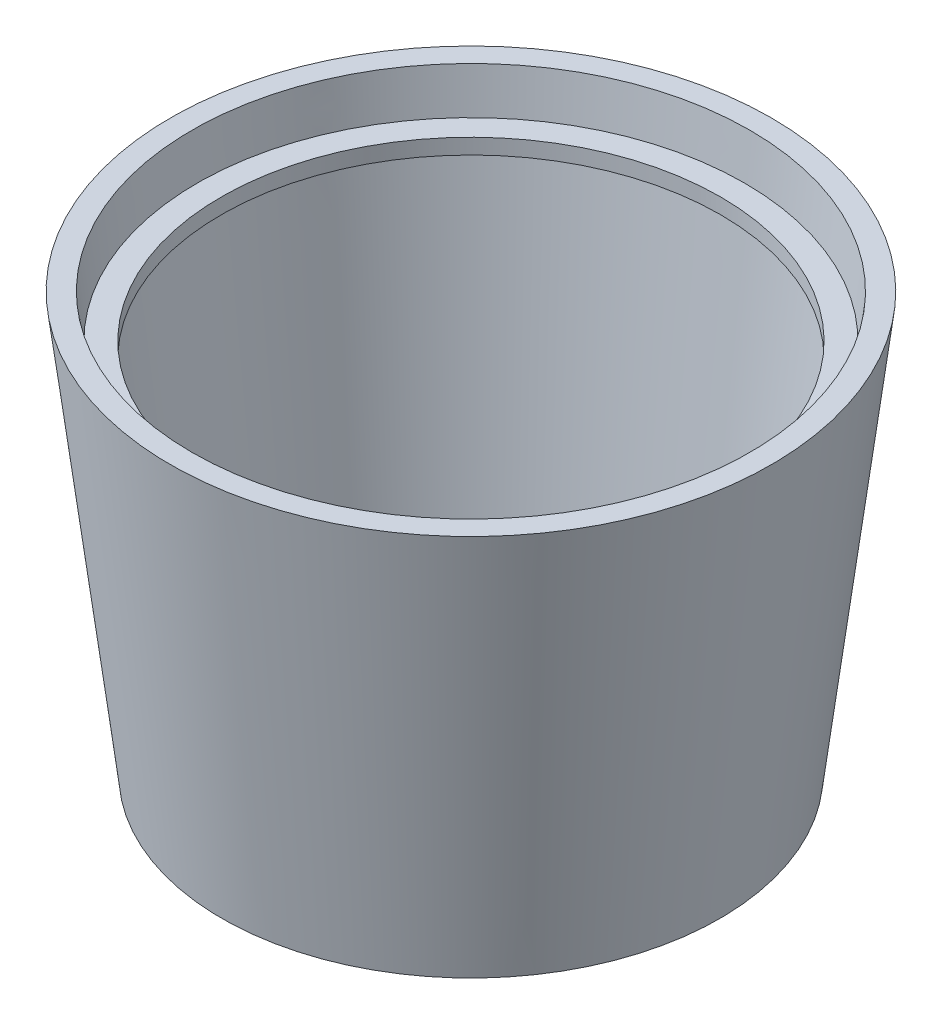
ISO-10303-21;
HEADER;
FILE_DESCRIPTION(('STEP AP214'),'2;1');
FILE_NAME('part.step','',(''),(''),'','','');
FILE_SCHEMA(('AUTOMOTIVE_DESIGN { 1 0 10303 214 1 1 1 1 }'));
ENDSEC;
DATA;
#1=APPLICATION_CONTEXT('core data for automotive mechanical design processes');
#2=APPLICATION_PROTOCOL_DEFINITION('international standard','automotive_design',2000,#1);
#3=PRODUCT_CONTEXT('',#1,'mechanical');
#4=PRODUCT('Part','Part','',(#3));
#5=PRODUCT_RELATED_PRODUCT_CATEGORY('part','',(#4));
#6=PRODUCT_DEFINITION_FORMATION('','',#4);
#7=PRODUCT_DEFINITION_CONTEXT('part definition',#1,'design');
#8=PRODUCT_DEFINITION('design','',#6,#7);
#9=PRODUCT_DEFINITION_SHAPE('','',#8);
#10=(LENGTH_UNIT() NAMED_UNIT(*) SI_UNIT(.MILLI.,.METRE.));
#11=(NAMED_UNIT(*) PLANE_ANGLE_UNIT() SI_UNIT($,.RADIAN.));
#12=(NAMED_UNIT(*) SI_UNIT($,.STERADIAN.) SOLID_ANGLE_UNIT());
#13=UNCERTAINTY_MEASURE_WITH_UNIT(LENGTH_MEASURE(1.E-05),#10,'distance_accuracy_value','');
#14=(GEOMETRIC_REPRESENTATION_CONTEXT(3) GLOBAL_UNCERTAINTY_ASSIGNED_CONTEXT((#13)) GLOBAL_UNIT_ASSIGNED_CONTEXT((#10,
#11,#12)) REPRESENTATION_CONTEXT('',''));
#15=CARTESIAN_POINT('',(0.,0.,0.));
#16=DIRECTION('',(0.,0.,1.));
#17=DIRECTION('',(1.,0.,0.));
#18=AXIS2_PLACEMENT_3D('',#15,#16,#17);
#19=CARTESIAN_POINT('',(-752.,0.,0.));
#20=DIRECTION('',(0.,-1.,0.));
#21=DIRECTION('',(0.,0.,-1.));
#22=AXIS2_PLACEMENT_3D('',#19,#20,#21);
#23=CYLINDRICAL_SURFACE('',#22,470.946113883419);
#24=CARTESIAN_POINT('',(-752.,0.,0.));
#25=DIRECTION('',(0.,-1.,0.));
#26=DIRECTION('',(0.,0.,-1.));
#27=AXIS2_PLACEMENT_3D('',#24,#25,#26);
#28=CIRCLE('',#27,470.946113883419);
#29=CARTESIAN_POINT('',(-752.,0.,-470.946113883419));
#30=VERTEX_POINT('',#29);
#31=EDGE_CURVE('E67',#30,#30,#28,.T.);
#32=ORIENTED_EDGE('',*,*,#31,.T.);
#33=EDGE_LOOP('',(#32));
#34=FACE_BOUND('',#33,.T.);
#35=CARTESIAN_POINT('',(-752.,14.,0.));
#36=DIRECTION('',(0.,-1.,0.));
#37=DIRECTION('',(0.,0.,-1.));
#38=AXIS2_PLACEMENT_3D('',#35,#36,#37);
#39=CIRCLE('',#38,470.946113883419);
#40=CARTESIAN_POINT('',(-752.,14.,-470.946113883419));
#41=VERTEX_POINT('',#40);
#42=EDGE_CURVE('E10',#41,#41,#39,.T.);
#43=ORIENTED_EDGE('',*,*,#42,.F.);
#44=EDGE_LOOP('',(#43));
#45=FACE_BOUND('',#44,.T.);
#46=ADVANCED_FACE('F33',(#34,#45),#23,.F.);
#47=CARTESIAN_POINT('',(-281.053886116581,13.9999999999999,0.));
#48=DIRECTION('',(0.,1.,0.));
#49=DIRECTION('',(0.,0.,1.));
#50=AXIS2_PLACEMENT_3D('',#47,#48,#49);
#51=PLANE('',#50);
#52=ORIENTED_EDGE('',*,*,#42,.T.);
#53=EDGE_LOOP('',(#52));
#54=FACE_BOUND('',#53,.T.);
#55=CARTESIAN_POINT('',(-752.,13.9999999999998,0.));
#56=DIRECTION('',(0.,-1.,0.));
#57=DIRECTION('',(0.,0.,-1.));
#58=AXIS2_PLACEMENT_3D('',#55,#56,#57);
#59=CIRCLE('',#58,504.848705121737);
#60=CARTESIAN_POINT('',(-752.,13.9999999999998,-504.848705121737));
#61=VERTEX_POINT('',#60);
#62=EDGE_CURVE('E39',#61,#61,#59,.T.);
#63=ORIENTED_EDGE('',*,*,#62,.F.);
#64=EDGE_LOOP('',(#63));
#65=FACE_BOUND('',#64,.T.);
#66=ADVANCED_FACE('F85',(#54,#65),#51,.T.);
#67=CARTESIAN_POINT('',(-752.,782.547470571913,0.));
#68=DIRECTION('',(0.,1.,0.));
#69=DIRECTION('',(0.,0.,1.));
#70=AXIS2_PLACEMENT_3D('',#67,#68,#69);
#71=CONICAL_SURFACE('',#70,599.214468828943,0.122173047639597);
#72=ORIENTED_EDGE('',*,*,#62,.T.);
#73=EDGE_LOOP('',(#72));
#74=FACE_BOUND('',#73,.T.);
#75=CARTESIAN_POINT('',(-752.,782.547470571913,0.));
#76=DIRECTION('',(0.,-1.,0.));
#77=DIRECTION('',(0.,0.,-1.));
#78=AXIS2_PLACEMENT_3D('',#75,#76,#77);
#79=CIRCLE('',#78,599.214468828943);
#80=CARTESIAN_POINT('',(-752.,782.547470571913,-599.214468828943));
#81=VERTEX_POINT('',#80);
#82=EDGE_CURVE('E43',#81,#81,#79,.T.);
#83=ORIENTED_EDGE('',*,*,#82,.F.);
#84=EDGE_LOOP('',(#83));
#85=FACE_BOUND('',#84,.T.);
#86=ADVANCED_FACE('F89',(#74,#85),#71,.F.);
#87=CARTESIAN_POINT('',(-209.399700552979,782.547470571913,0.));
#88=DIRECTION('',(0.,-1.,0.));
#89=DIRECTION('',(0.,0.,-1.));
#90=AXIS2_PLACEMENT_3D('',#87,#88,#89);
#91=PLANE('',#90);
#92=ORIENTED_EDGE('',*,*,#82,.T.);
#93=EDGE_LOOP('',(#92));
#94=FACE_BOUND('',#93,.T.);
#95=CARTESIAN_POINT('',(-752.,782.547470571913,0.));
#96=DIRECTION('',(0.,-1.,0.));
#97=DIRECTION('',(0.,0.,-1.));
#98=AXIS2_PLACEMENT_3D('',#95,#96,#97);
#99=CIRCLE('',#98,542.600299447021);
#100=CARTESIAN_POINT('',(-752.,782.547470571913,-542.600299447021));
#101=VERTEX_POINT('',#100);
#102=EDGE_CURVE('E47',#101,#101,#99,.T.);
#103=ORIENTED_EDGE('',*,*,#102,.F.);
#104=EDGE_LOOP('',(#103));
#105=FACE_BOUND('',#104,.T.);
#106=ADVANCED_FACE('F93',(#94,#105),#91,.T.);
#107=CARTESIAN_POINT('',(-752.,0.,0.));
#108=DIRECTION('',(0.,-1.,0.));
#109=DIRECTION('',(0.,0.,-1.));
#110=AXIS2_PLACEMENT_3D('',#107,#108,#109);
#111=CYLINDRICAL_SURFACE('',#110,542.600299447021);
#112=ORIENTED_EDGE('',*,*,#102,.T.);
#113=EDGE_LOOP('',(#112));
#114=FACE_BOUND('',#113,.T.);
#115=CARTESIAN_POINT('',(-752.,816.020925685912,0.));
#116=DIRECTION('',(0.,-1.,0.));
#117=DIRECTION('',(0.,0.,-1.));
#118=AXIS2_PLACEMENT_3D('',#115,#116,#117);
#119=CIRCLE('',#118,542.600299447021);
#120=CARTESIAN_POINT('',(-752.,816.020925685912,-542.600299447021));
#121=VERTEX_POINT('',#120);
#122=EDGE_CURVE('E52',#121,#121,#119,.T.);
#123=ORIENTED_EDGE('',*,*,#122,.F.);
#124=EDGE_LOOP('',(#123));
#125=FACE_BOUND('',#124,.T.);
#126=ADVANCED_FACE('F99',(#114,#125),#111,.F.);
#127=CARTESIAN_POINT('',(-157.271259397007,816.020925685912,0.));
#128=DIRECTION('',(0.,1.,0.));
#129=DIRECTION('',(0.,0.,1.));
#130=AXIS2_PLACEMENT_3D('',#127,#128,#129);
#131=PLANE('',#130);
#132=ORIENTED_EDGE('',*,*,#122,.T.);
#133=EDGE_LOOP('',(#132));
#134=FACE_BOUND('',#133,.T.);
#135=CARTESIAN_POINT('',(-752.,816.020925685912,0.));
#136=DIRECTION('',(0.,-1.,0.));
#137=DIRECTION('',(0.,0.,-1.));
#138=AXIS2_PLACEMENT_3D('',#135,#136,#137);
#139=CIRCLE('',#138,594.728740602994);
#140=CARTESIAN_POINT('',(-752.,816.020925685912,-594.728740602994));
#141=VERTEX_POINT('',#140);
#142=EDGE_CURVE('E55',#141,#141,#139,.T.);
#143=ORIENTED_EDGE('',*,*,#142,.F.);
#144=EDGE_LOOP('',(#143));
#145=FACE_BOUND('',#144,.T.);
#146=ADVANCED_FACE('F103',(#134,#145),#131,.T.);
#147=CARTESIAN_POINT('',(-752.,909.798542753876,0.));
#148=DIRECTION('',(0.,1.,0.));
#149=DIRECTION('',(0.,0.,1.));
#150=AXIS2_PLACEMENT_3D('',#147,#148,#149);
#151=CONICAL_SURFACE('',#150,606.243184137204,0.122173047639596);
#152=ORIENTED_EDGE('',*,*,#142,.T.);
#153=EDGE_LOOP('',(#152));
#154=FACE_BOUND('',#153,.T.);
#155=CARTESIAN_POINT('',(-752.,909.798542753876,0.));
#156=DIRECTION('',(0.,-1.,0.));
#157=DIRECTION('',(0.,0.,-1.));
#158=AXIS2_PLACEMENT_3D('',#155,#156,#157);
#159=CIRCLE('',#158,606.243184137204);
#160=CARTESIAN_POINT('',(-752.,909.798542753876,-606.243184137204));
#161=VERTEX_POINT('',#160);
#162=EDGE_CURVE('E58',#161,#161,#159,.T.);
#163=ORIENTED_EDGE('',*,*,#162,.F.);
#164=EDGE_LOOP('',(#163));
#165=FACE_BOUND('',#164,.T.);
#166=ADVANCED_FACE('F107',(#154,#165),#151,.F.);
#167=CARTESIAN_POINT('',(-99.2602651852211,909.798542753876,0.));
#168=DIRECTION('',(0.,1.,0.));
#169=DIRECTION('',(0.,0.,1.));
#170=AXIS2_PLACEMENT_3D('',#167,#168,#169);
#171=PLANE('',#170);
#172=ORIENTED_EDGE('',*,*,#162,.T.);
#173=EDGE_LOOP('',(#172));
#174=FACE_BOUND('',#173,.T.);
#175=CARTESIAN_POINT('',(-752.,909.798542753876,0.));
#176=DIRECTION('',(0.,-1.,0.));
#177=DIRECTION('',(0.,0.,-1.));
#178=AXIS2_PLACEMENT_3D('',#175,#176,#177);
#179=CIRCLE('',#178,652.739734814779);
#180=CARTESIAN_POINT('',(-752.,909.798542753876,-652.739734814779));
#181=VERTEX_POINT('',#180);
#182=EDGE_CURVE('E61',#181,#181,#179,.T.);
#183=ORIENTED_EDGE('',*,*,#182,.F.);
#184=EDGE_LOOP('',(#183));
#185=FACE_BOUND('',#184,.T.);
#186=ADVANCED_FACE('F81',(#174,#185),#171,.T.);
#187=CARTESIAN_POINT('',(-752.,-1.90735147709151E-13,0.));
#188=DIRECTION('',(0.,1.,0.));
#189=DIRECTION('',(0.,0.,1.));
#190=AXIS2_PLACEMENT_3D('',#187,#188,#189);
#191=CONICAL_SURFACE('',#190,541.030520232647,0.122173047639597);
#192=ORIENTED_EDGE('',*,*,#182,.T.);
#193=EDGE_LOOP('',(#192));
#194=FACE_BOUND('',#193,.T.);
#195=CARTESIAN_POINT('',(-752.,-1.90735147709151E-13,0.));
#196=DIRECTION('',(0.,-1.,0.));
#197=DIRECTION('',(0.,0.,-1.));
#198=AXIS2_PLACEMENT_3D('',#195,#196,#197);
#199=CIRCLE('',#198,541.030520232647);
#200=CARTESIAN_POINT('',(-752.,-1.90735147709151E-13,-541.030520232647));
#201=VERTEX_POINT('',#200);
#202=EDGE_CURVE('E64',#201,#201,#199,.T.);
#203=ORIENTED_EDGE('',*,*,#202,.F.);
#204=EDGE_LOOP('',(#203));
#205=FACE_BOUND('',#204,.T.);
#206=ADVANCED_FACE('F75',(#194,#205),#191,.T.);
#207=CARTESIAN_POINT('',(-281.053886116581,0.,0.));
#208=DIRECTION('',(0.,-1.,0.));
#209=DIRECTION('',(0.,0.,-1.));
#210=AXIS2_PLACEMENT_3D('',#207,#208,#209);
#211=PLANE('',#210);
#212=ORIENTED_EDGE('',*,*,#202,.T.);
#213=EDGE_LOOP('',(#212));
#214=FACE_BOUND('',#213,.T.);
#215=ORIENTED_EDGE('',*,*,#31,.F.);
#216=EDGE_LOOP('',(#215));
#217=FACE_BOUND('',#216,.T.);
#218=ADVANCED_FACE('F73',(#214,#217),#211,.T.);
#219=CLOSED_SHELL('',(#46,#66,#86,#106,#126,#146,#166,#186,#206,#218));
#220=MANIFOLD_SOLID_BREP('B2',#219);
#221=ADVANCED_BREP_SHAPE_REPRESENTATION('',(#18,#220),#14);
#222=SHAPE_DEFINITION_REPRESENTATION(#9,#221);
ENDSEC;
END-ISO-10303-21;
